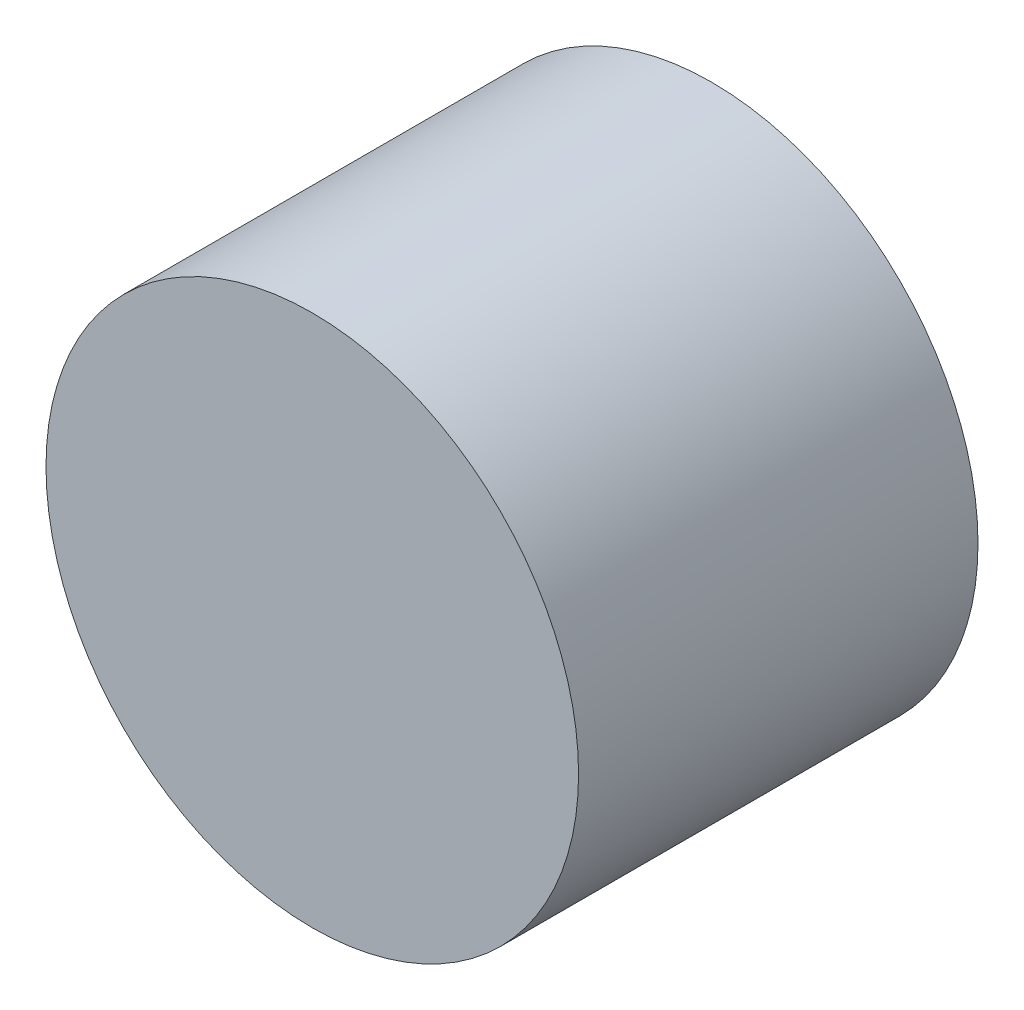
ISO-10303-21;
HEADER;
FILE_DESCRIPTION(('STEP AP214'),'2;1');
FILE_NAME('part.step','',(''),(''),'','','');
FILE_SCHEMA(('AUTOMOTIVE_DESIGN { 1 0 10303 214 1 1 1 1 }'));
ENDSEC;
DATA;
#1=APPLICATION_CONTEXT('core data for automotive mechanical design processes');
#2=APPLICATION_PROTOCOL_DEFINITION('international standard','automotive_design',2000,#1);
#3=PRODUCT_CONTEXT('',#1,'mechanical');
#4=PRODUCT('Part','Part','',(#3));
#5=PRODUCT_RELATED_PRODUCT_CATEGORY('part','',(#4));
#6=PRODUCT_DEFINITION_FORMATION('','',#4);
#7=PRODUCT_DEFINITION_CONTEXT('part definition',#1,'design');
#8=PRODUCT_DEFINITION('design','',#6,#7);
#9=PRODUCT_DEFINITION_SHAPE('','',#8);
#10=(LENGTH_UNIT() NAMED_UNIT(*) SI_UNIT(.MILLI.,.METRE.));
#11=(NAMED_UNIT(*) PLANE_ANGLE_UNIT() SI_UNIT($,.RADIAN.));
#12=(NAMED_UNIT(*) SI_UNIT($,.STERADIAN.) SOLID_ANGLE_UNIT());
#13=UNCERTAINTY_MEASURE_WITH_UNIT(LENGTH_MEASURE(1.E-05),#10,'distance_accuracy_value','');
#14=(GEOMETRIC_REPRESENTATION_CONTEXT(3) GLOBAL_UNCERTAINTY_ASSIGNED_CONTEXT((#13)) GLOBAL_UNIT_ASSIGNED_CONTEXT((#10,
#11,#12)) REPRESENTATION_CONTEXT('',''));
#15=CARTESIAN_POINT('',(0.,0.,0.));
#16=DIRECTION('',(0.,0.,1.));
#17=DIRECTION('',(1.,0.,0.));
#18=AXIS2_PLACEMENT_3D('',#15,#16,#17);
#19=CARTESIAN_POINT('',(0.,0.,15.));
#20=DIRECTION('',(0.,0.,-1.));
#21=DIRECTION('',(-1.,0.,0.));
#22=AXIS2_PLACEMENT_3D('',#19,#20,#21);
#23=CYLINDRICAL_SURFACE('',#22,10.);
#24=CARTESIAN_POINT('',(0.,0.,15.));
#25=DIRECTION('',(0.,0.,1.));
#26=DIRECTION('',(1.,0.,0.));
#27=AXIS2_PLACEMENT_3D('',#24,#25,#26);
#28=CIRCLE('',#27,10.);
#29=CARTESIAN_POINT('',(10.,0.,15.));
#30=VERTEX_POINT('',#29);
#31=EDGE_CURVE('E10',#30,#30,#28,.T.);
#32=ORIENTED_EDGE('',*,*,#31,.F.);
#33=EDGE_LOOP('',(#32));
#34=FACE_BOUND('',#33,.T.);
#35=CARTESIAN_POINT('',(0.,0.,0.));
#36=DIRECTION('',(0.,0.,1.));
#37=DIRECTION('',(1.,0.,0.));
#38=AXIS2_PLACEMENT_3D('',#35,#36,#37);
#39=CIRCLE('',#38,10.);
#40=CARTESIAN_POINT('',(10.,0.,0.));
#41=VERTEX_POINT('',#40);
#42=EDGE_CURVE('E46',#41,#41,#39,.T.);
#43=ORIENTED_EDGE('',*,*,#42,.T.);
#44=EDGE_LOOP('',(#43));
#45=FACE_BOUND('',#44,.T.);
#46=ADVANCED_FACE('F43',(#34,#45),#23,.T.);
#47=CARTESIAN_POINT('',(0.,0.,15.));
#48=DIRECTION('',(0.,0.,1.));
#49=DIRECTION('',(1.,0.,0.));
#50=AXIS2_PLACEMENT_3D('',#47,#48,#49);
#51=PLANE('',#50);
#52=ORIENTED_EDGE('',*,*,#31,.T.);
#53=EDGE_LOOP('',(#52));
#54=FACE_BOUND('',#53,.T.);
#55=ADVANCED_FACE('F60',(#54),#51,.T.);
#56=CARTESIAN_POINT('',(0.,0.,0.));
#57=DIRECTION('',(0.,0.,1.));
#58=DIRECTION('',(1.,0.,0.));
#59=AXIS2_PLACEMENT_3D('',#56,#57,#58);
#60=PLANE('',#59);
#61=ORIENTED_EDGE('',*,*,#42,.F.);
#62=EDGE_LOOP('',(#61));
#63=FACE_BOUND('',#62,.T.);
#64=ADVANCED_FACE('F58',(#63),#60,.F.);
#65=CLOSED_SHELL('',(#46,#55,#64));
#66=MANIFOLD_SOLID_BREP('B2',#65);
#67=ADVANCED_BREP_SHAPE_REPRESENTATION('',(#18,#66),#14);
#68=SHAPE_DEFINITION_REPRESENTATION(#9,#67);
ENDSEC;
END-ISO-10303-21;
